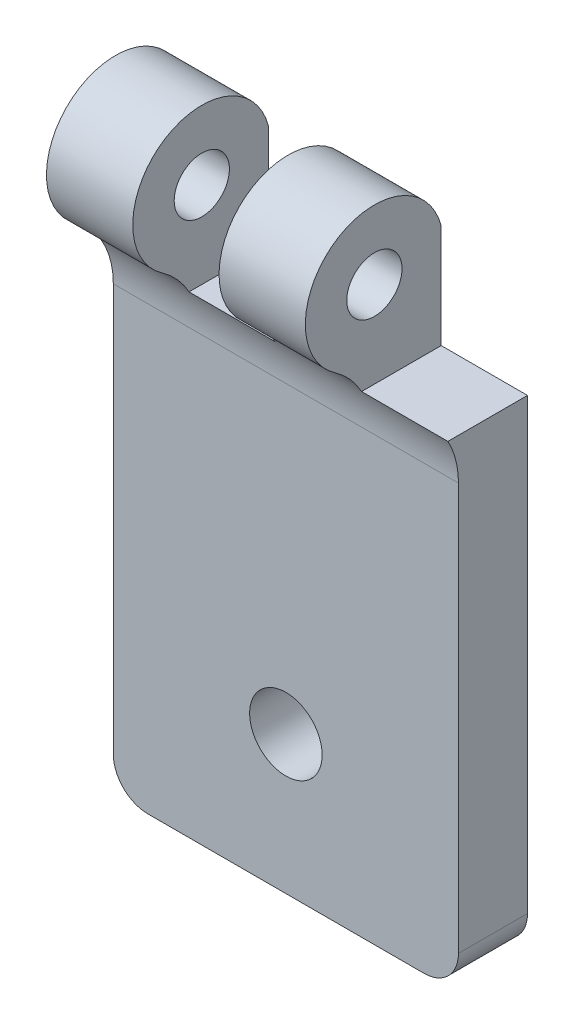
ISO-10303-21;
HEADER;
FILE_DESCRIPTION(('STEP AP214'),'2;1');
FILE_NAME('part.step','',(''),(''),'','','');
FILE_SCHEMA(('AUTOMOTIVE_DESIGN { 1 0 10303 214 1 1 1 1 }'));
ENDSEC;
DATA;
#1=APPLICATION_CONTEXT('core data for automotive mechanical design processes');
#2=APPLICATION_PROTOCOL_DEFINITION('international standard','automotive_design',2000,#1);
#3=PRODUCT_CONTEXT('',#1,'mechanical');
#4=PRODUCT('Part','Part','',(#3));
#5=PRODUCT_RELATED_PRODUCT_CATEGORY('part','',(#4));
#6=PRODUCT_DEFINITION_FORMATION('','',#4);
#7=PRODUCT_DEFINITION_CONTEXT('part definition',#1,'design');
#8=PRODUCT_DEFINITION('design','',#6,#7);
#9=PRODUCT_DEFINITION_SHAPE('','',#8);
#10=(LENGTH_UNIT() NAMED_UNIT(*) SI_UNIT(.MILLI.,.METRE.));
#11=(NAMED_UNIT(*) PLANE_ANGLE_UNIT() SI_UNIT($,.RADIAN.));
#12=(NAMED_UNIT(*) SI_UNIT($,.STERADIAN.) SOLID_ANGLE_UNIT());
#13=UNCERTAINTY_MEASURE_WITH_UNIT(LENGTH_MEASURE(1.E-05),#10,'distance_accuracy_value','');
#14=(GEOMETRIC_REPRESENTATION_CONTEXT(3) GLOBAL_UNCERTAINTY_ASSIGNED_CONTEXT((#13)) GLOBAL_UNIT_ASSIGNED_CONTEXT((#10,
#11,#12)) REPRESENTATION_CONTEXT('',''));
#15=CARTESIAN_POINT('',(0.,0.,0.));
#16=DIRECTION('',(0.,0.,1.));
#17=DIRECTION('',(1.,0.,0.));
#18=AXIS2_PLACEMENT_3D('',#15,#16,#17);
#19=CARTESIAN_POINT('',(-31.2224351555829,32.9979661007594,3.87245762594928));
#20=DIRECTION('',(1.,0.,0.));
#21=DIRECTION('',(0.,0.,-1.));
#22=AXIS2_PLACEMENT_3D('',#19,#20,#21);
#23=CYLINDRICAL_SURFACE('',#22,4.);
#24=CARTESIAN_POINT('',(-10.,32.9979661007594,3.87245762594928));
#25=DIRECTION('',(1.,0.,0.));
#26=DIRECTION('',(0.,0.,-1.));
#27=AXIS2_PLACEMENT_3D('',#24,#25,#26);
#28=CIRCLE('',#27,4.);
#29=CARTESIAN_POINT('',(-10.,29.7106298545688,6.1513653477496));
#30=VERTEX_POINT('',#29);
#31=CARTESIAN_POINT('',(-10.,34.,0.));
#32=VERTEX_POINT('',#31);
#33=EDGE_CURVE('E140',#30,#32,#28,.F.);
#34=ORIENTED_EDGE('',*,*,#33,.F.);
#35=DIRECTION('',(1.,0.,0.));
#36=VECTOR('',#35,1.);
#37=CARTESIAN_POINT('',(-31.2224351555829,29.7106298545688,6.1513653477496));
#38=LINE('',#37,#36);
#39=CARTESIAN_POINT('',(-5.,29.7106298545688,6.1513653477496));
#40=VERTEX_POINT('',#39);
#41=EDGE_CURVE('E198',#30,#40,#38,.T.);
#42=ORIENTED_EDGE('',*,*,#41,.T.);
#43=CARTESIAN_POINT('',(-5.,32.9979661007594,3.87245762594928));
#44=DIRECTION('',(-1.,0.,0.));
#45=DIRECTION('',(0.,0.,1.));
#46=AXIS2_PLACEMENT_3D('',#43,#44,#45);
#47=CIRCLE('',#46,4.);
#48=CARTESIAN_POINT('',(-5.,34.,0.));
#49=VERTEX_POINT('',#48);
#50=EDGE_CURVE('E172',#49,#40,#47,.F.);
#51=ORIENTED_EDGE('',*,*,#50,.F.);
#52=DIRECTION('',(-1.,0.,0.));
#53=VECTOR('',#52,1.);
#54=CARTESIAN_POINT('',(0.,34.,0.));
#55=LINE('',#54,#53);
#56=EDGE_CURVE('E202',#49,#32,#55,.T.);
#57=ORIENTED_EDGE('',*,*,#56,.T.);
#58=EDGE_LOOP('',(#34,#42,#51,#57));
#59=FACE_BOUND('',#58,.T.);
#60=ADVANCED_FACE('F32',(#59),#23,.T.);
#61=CARTESIAN_POINT('',(-20.,32.9979661007594,3.87245762594928));
#62=DIRECTION('',(1.,0.,0.));
#63=DIRECTION('',(0.,0.,-1.));
#64=AXIS2_PLACEMENT_3D('',#61,#62,#63);
#65=CYLINDRICAL_SURFACE('',#64,1.6);
#66=CARTESIAN_POINT('',(-10.,32.9979661007594,3.87245762594928));
#67=DIRECTION('',(1.,0.,0.));
#68=DIRECTION('',(0.,0.,-1.));
#69=AXIS2_PLACEMENT_3D('',#66,#67,#68);
#70=CIRCLE('',#69,1.6);
#71=CARTESIAN_POINT('',(-10.,32.9979661007594,2.27245762594928));
#72=VERTEX_POINT('',#71);
#73=EDGE_CURVE('E157',#72,#72,#70,.F.);
#74=ORIENTED_EDGE('',*,*,#73,.T.);
#75=EDGE_LOOP('',(#74));
#76=FACE_BOUND('',#75,.T.);
#77=CARTESIAN_POINT('',(-5.,32.9979661007594,3.87245762594928));
#78=DIRECTION('',(-1.,0.,0.));
#79=DIRECTION('',(0.,0.,1.));
#80=AXIS2_PLACEMENT_3D('',#77,#78,#79);
#81=CIRCLE('',#80,1.6);
#82=CARTESIAN_POINT('',(-5.,32.9979661007594,5.47245762594928));
#83=VERTEX_POINT('',#82);
#84=EDGE_CURVE('E167',#83,#83,#81,.F.);
#85=ORIENTED_EDGE('',*,*,#84,.T.);
#86=EDGE_LOOP('',(#85));
#87=FACE_BOUND('',#86,.T.);
#88=ADVANCED_FACE('F244',(#76,#87),#65,.F.);
#89=CARTESIAN_POINT('',(0.,0.,4.));
#90=DIRECTION('',(-1.,0.,0.));
#91=DIRECTION('',(0.,0.,1.));
#92=AXIS2_PLACEMENT_3D('',#89,#90,#91);
#93=PLANE('',#92);
#94=DIRECTION('',(0.,1.,0.));
#95=VECTOR('',#94,1.);
#96=CARTESIAN_POINT('',(0.,0.,0.));
#97=LINE('',#96,#95);
#98=CARTESIAN_POINT('',(0.,2.,0.));
#99=VERTEX_POINT('',#98);
#100=CARTESIAN_POINT('',(0.,28.,0.));
#101=VERTEX_POINT('',#100);
#102=EDGE_CURVE('E187',#99,#101,#97,.T.);
#103=ORIENTED_EDGE('',*,*,#102,.T.);
#104=DIRECTION('',(0.,0.,-1.));
#105=VECTOR('',#104,1.);
#106=CARTESIAN_POINT('',(0.,28.,7.87245762594928));
#107=LINE('',#106,#105);
#108=CARTESIAN_POINT('',(0.,28.,4.61285928029324));
#109=VERTEX_POINT('',#108);
#110=EDGE_CURVE('E165',#109,#101,#107,.T.);
#111=ORIENTED_EDGE('',*,*,#110,.F.);
#112=CARTESIAN_POINT('',(0.,25.6014595468304,9.));
#113=DIRECTION('',(-1.,0.,0.));
#114=DIRECTION('',(0.,0.,1.));
#115=AXIS2_PLACEMENT_3D('',#112,#113,#114);
#116=CIRCLE('',#115,5.);
#117=CARTESIAN_POINT('',(0.,25.6014595468304,4.));
#118=VERTEX_POINT('',#117);
#119=EDGE_CURVE('E214',#109,#118,#116,.T.);
#120=ORIENTED_EDGE('',*,*,#119,.T.);
#121=DIRECTION('',(0.,1.,0.));
#122=VECTOR('',#121,1.);
#123=CARTESIAN_POINT('',(0.,0.,4.));
#124=LINE('',#123,#122);
#125=CARTESIAN_POINT('',(0.,2.,4.));
#126=VERTEX_POINT('',#125);
#127=EDGE_CURVE('E188',#126,#118,#124,.T.);
#128=ORIENTED_EDGE('',*,*,#127,.F.);
#129=DIRECTION('',(0.,0.,-1.));
#130=VECTOR('',#129,1.);
#131=CARTESIAN_POINT('',(0.,2.,4.));
#132=LINE('',#131,#130);
#133=EDGE_CURVE('E218',#126,#99,#132,.T.);
#134=ORIENTED_EDGE('',*,*,#133,.T.);
#135=EDGE_LOOP('',(#103,#111,#120,#128,#134));
#136=FACE_BOUND('',#135,.T.);
#137=ADVANCED_FACE('F265',(#136),#93,.F.);
#138=CARTESIAN_POINT('',(-20.,0.,4.));
#139=DIRECTION('',(1.,0.,0.));
#140=DIRECTION('',(0.,0.,-1.));
#141=AXIS2_PLACEMENT_3D('',#138,#139,#140);
#142=PLANE('',#141);
#143=CARTESIAN_POINT('',(-20.,32.9979661007594,3.87245762594928));
#144=DIRECTION('',(1.,0.,0.));
#145=DIRECTION('',(0.,0.,-1.));
#146=AXIS2_PLACEMENT_3D('',#143,#144,#145);
#147=CIRCLE('',#146,1.6);
#148=CARTESIAN_POINT('',(-20.,32.9979661007594,2.27245762594928));
#149=VERTEX_POINT('',#148);
#150=EDGE_CURVE('E179',#149,#149,#147,.T.);
#151=ORIENTED_EDGE('',*,*,#150,.T.);
#152=EDGE_LOOP('',(#151));
#153=FACE_BOUND('',#152,.T.);
#154=DIRECTION('',(0.,-1.,0.));
#155=VECTOR('',#154,1.);
#156=CARTESIAN_POINT('',(-20.,0.,0.));
#157=LINE('',#156,#155);
#158=CARTESIAN_POINT('',(-20.,34.,0.));
#159=VERTEX_POINT('',#158);
#160=CARTESIAN_POINT('',(-20.,2.,0.));
#161=VERTEX_POINT('',#160);
#162=EDGE_CURVE('E204',#159,#161,#157,.T.);
#163=ORIENTED_EDGE('',*,*,#162,.T.);
#164=DIRECTION('',(0.,0.,-1.));
#165=VECTOR('',#164,1.);
#166=CARTESIAN_POINT('',(-20.,2.,4.));
#167=LINE('',#166,#165);
#168=CARTESIAN_POINT('',(-20.,2.,4.));
#169=VERTEX_POINT('',#168);
#170=EDGE_CURVE('E234',#161,#169,#167,.F.);
#171=ORIENTED_EDGE('',*,*,#170,.T.);
#172=DIRECTION('',(0.,-1.,0.));
#173=VECTOR('',#172,1.);
#174=CARTESIAN_POINT('',(-20.,0.,4.));
#175=LINE('',#174,#173);
#176=CARTESIAN_POINT('',(-20.,25.6014595468304,4.));
#177=VERTEX_POINT('',#176);
#178=EDGE_CURVE('E191',#177,#169,#175,.T.);
#179=ORIENTED_EDGE('',*,*,#178,.F.);
#180=CARTESIAN_POINT('',(-20.,25.6014595468304,9.));
#181=DIRECTION('',(1.,0.,0.));
#182=DIRECTION('',(0.,0.,-1.));
#183=AXIS2_PLACEMENT_3D('',#180,#181,#182);
#184=CIRCLE('',#183,5.);
#185=CARTESIAN_POINT('',(-20.,29.7106298545688,6.1513653477496));
#186=VERTEX_POINT('',#185);
#187=EDGE_CURVE('E216',#177,#186,#184,.T.);
#188=ORIENTED_EDGE('',*,*,#187,.T.);
#189=CARTESIAN_POINT('',(-20.,32.9979661007594,3.87245762594928));
#190=DIRECTION('',(1.,0.,0.));
#191=DIRECTION('',(0.,0.,-1.));
#192=AXIS2_PLACEMENT_3D('',#189,#190,#191);
#193=CIRCLE('',#192,4.);
#194=EDGE_CURVE('E184',#186,#159,#193,.F.);
#195=ORIENTED_EDGE('',*,*,#194,.T.);
#196=EDGE_LOOP('',(#163,#171,#179,#188,#195));
#197=FACE_BOUND('',#196,.T.);
#198=ADVANCED_FACE('F295',(#153,#197),#142,.F.);
#199=CARTESIAN_POINT('',(0.,0.,4.));
#200=DIRECTION('',(0.,1.,0.));
#201=DIRECTION('',(-1.,0.,0.));
#202=AXIS2_PLACEMENT_3D('',#199,#200,#201);
#203=PLANE('',#202);
#204=DIRECTION('',(1.,0.,0.));
#205=VECTOR('',#204,1.);
#206=CARTESIAN_POINT('',(0.,0.,0.));
#207=LINE('',#206,#205);
#208=CARTESIAN_POINT('',(-18.,0.,0.));
#209=VERTEX_POINT('',#208);
#210=CARTESIAN_POINT('',(-2.,0.,0.));
#211=VERTEX_POINT('',#210);
#212=EDGE_CURVE('E192',#209,#211,#207,.T.);
#213=ORIENTED_EDGE('',*,*,#212,.T.);
#214=DIRECTION('',(0.,0.,-1.));
#215=VECTOR('',#214,1.);
#216=CARTESIAN_POINT('',(-2.,0.,4.));
#217=LINE('',#216,#215);
#218=CARTESIAN_POINT('',(-2.,0.,4.));
#219=VERTEX_POINT('',#218);
#220=EDGE_CURVE('E228',#211,#219,#217,.F.);
#221=ORIENTED_EDGE('',*,*,#220,.T.);
#222=DIRECTION('',(1.,0.,0.));
#223=VECTOR('',#222,1.);
#224=CARTESIAN_POINT('',(0.,0.,4.));
#225=LINE('',#224,#223);
#226=CARTESIAN_POINT('',(-18.,0.,4.));
#227=VERTEX_POINT('',#226);
#228=EDGE_CURVE('E195',#227,#219,#225,.T.);
#229=ORIENTED_EDGE('',*,*,#228,.F.);
#230=DIRECTION('',(0.,0.,-1.));
#231=VECTOR('',#230,1.);
#232=CARTESIAN_POINT('',(-18.,0.,4.));
#233=LINE('',#232,#231);
#234=EDGE_CURVE('E225',#227,#209,#233,.T.);
#235=ORIENTED_EDGE('',*,*,#234,.T.);
#236=EDGE_LOOP('',(#213,#221,#229,#235));
#237=FACE_BOUND('',#236,.T.);
#238=ADVANCED_FACE('F298',(#237),#203,.F.);
#239=CARTESIAN_POINT('',(0.,0.,4.));
#240=DIRECTION('',(0.,0.,1.));
#241=DIRECTION('',(1.,0.,0.));
#242=AXIS2_PLACEMENT_3D('',#239,#240,#241);
#243=PLANE('',#242);
#244=CARTESIAN_POINT('',(-10.,8.,4.));
#245=DIRECTION('',(0.,0.,1.));
#246=DIRECTION('',(1.,0.,0.));
#247=AXIS2_PLACEMENT_3D('',#244,#245,#246);
#248=CIRCLE('',#247,2.1);
#249=CARTESIAN_POINT('',(-7.9,8.,4.));
#250=VERTEX_POINT('',#249);
#251=EDGE_CURVE('E175',#250,#250,#248,.T.);
#252=ORIENTED_EDGE('',*,*,#251,.F.);
#253=EDGE_LOOP('',(#252));
#254=FACE_BOUND('',#253,.T.);
#255=ORIENTED_EDGE('',*,*,#228,.T.);
#256=CARTESIAN_POINT('',(-2.,2.,4.));
#257=DIRECTION('',(0.,0.,1.));
#258=DIRECTION('',(1.,0.,0.));
#259=AXIS2_PLACEMENT_3D('',#256,#257,#258);
#260=CIRCLE('',#259,2.);
#261=EDGE_CURVE('E232',#219,#126,#260,.T.);
#262=ORIENTED_EDGE('',*,*,#261,.T.);
#263=ORIENTED_EDGE('',*,*,#127,.T.);
#264=DIRECTION('',(-1.,0.,0.));
#265=VECTOR('',#264,1.);
#266=CARTESIAN_POINT('',(-20.,25.6014595468304,4.));
#267=LINE('',#266,#265);
#268=EDGE_CURVE('E212',#118,#177,#267,.T.);
#269=ORIENTED_EDGE('',*,*,#268,.T.);
#270=ORIENTED_EDGE('',*,*,#178,.T.);
#271=CARTESIAN_POINT('',(-18.,2.,4.));
#272=DIRECTION('',(0.,0.,1.));
#273=DIRECTION('',(1.,0.,0.));
#274=AXIS2_PLACEMENT_3D('',#271,#272,#273);
#275=CIRCLE('',#274,2.);
#276=EDGE_CURVE('E230',#169,#227,#275,.T.);
#277=ORIENTED_EDGE('',*,*,#276,.T.);
#278=EDGE_LOOP('',(#255,#262,#263,#269,#270,#277));
#279=FACE_BOUND('',#278,.T.);
#280=ADVANCED_FACE('F278',(#254,#279),#243,.T.);
#281=CARTESIAN_POINT('',(0.,0.,0.));
#282=DIRECTION('',(0.,0.,1.));
#283=DIRECTION('',(1.,0.,0.));
#284=AXIS2_PLACEMENT_3D('',#281,#282,#283);
#285=PLANE('',#284);
#286=CARTESIAN_POINT('',(-10.,8.,0.));
#287=DIRECTION('',(0.,0.,1.));
#288=DIRECTION('',(1.,0.,0.));
#289=AXIS2_PLACEMENT_3D('',#286,#287,#288);
#290=CIRCLE('',#289,2.1);
#291=CARTESIAN_POINT('',(-7.9,8.,0.));
#292=VERTEX_POINT('',#291);
#293=EDGE_CURVE('E176',#292,#292,#290,.T.);
#294=ORIENTED_EDGE('',*,*,#293,.T.);
#295=EDGE_LOOP('',(#294));
#296=FACE_BOUND('',#295,.T.);
#297=DIRECTION('',(-1.,0.,0.));
#298=VECTOR('',#297,1.);
#299=CARTESIAN_POINT('',(-10.,28.,0.));
#300=LINE('',#299,#298);
#301=CARTESIAN_POINT('',(-10.,28.,0.));
#302=VERTEX_POINT('',#301);
#303=CARTESIAN_POINT('',(-15.,28.,0.));
#304=VERTEX_POINT('',#303);
#305=EDGE_CURVE('E129',#302,#304,#300,.T.);
#306=ORIENTED_EDGE('',*,*,#305,.F.);
#307=DIRECTION('',(0.,-1.,0.));
#308=VECTOR('',#307,1.);
#309=CARTESIAN_POINT('',(-10.,28.,0.));
#310=LINE('',#309,#308);
#311=EDGE_CURVE('E137',#32,#302,#310,.T.);
#312=ORIENTED_EDGE('',*,*,#311,.F.);
#313=ORIENTED_EDGE('',*,*,#56,.F.);
#314=DIRECTION('',(0.,1.,0.));
#315=VECTOR('',#314,1.);
#316=CARTESIAN_POINT('',(-5.,28.,0.));
#317=LINE('',#316,#315);
#318=CARTESIAN_POINT('',(-5.,28.,0.));
#319=VERTEX_POINT('',#318);
#320=EDGE_CURVE('E163',#319,#49,#317,.T.);
#321=ORIENTED_EDGE('',*,*,#320,.F.);
#322=DIRECTION('',(-1.,0.,0.));
#323=VECTOR('',#322,1.);
#324=CARTESIAN_POINT('',(0.,28.,0.));
#325=LINE('',#324,#323);
#326=EDGE_CURVE('E161',#101,#319,#325,.T.);
#327=ORIENTED_EDGE('',*,*,#326,.F.);
#328=ORIENTED_EDGE('',*,*,#102,.F.);
#329=CARTESIAN_POINT('',(-2.,2.,0.));
#330=DIRECTION('',(0.,0.,1.));
#331=DIRECTION('',(1.,0.,0.));
#332=AXIS2_PLACEMENT_3D('',#329,#330,#331);
#333=CIRCLE('',#332,2.);
#334=EDGE_CURVE('E223',#99,#211,#333,.F.);
#335=ORIENTED_EDGE('',*,*,#334,.T.);
#336=ORIENTED_EDGE('',*,*,#212,.F.);
#337=CARTESIAN_POINT('',(-18.,2.,0.));
#338=DIRECTION('',(0.,0.,1.));
#339=DIRECTION('',(1.,0.,0.));
#340=AXIS2_PLACEMENT_3D('',#337,#338,#339);
#341=CIRCLE('',#340,2.);
#342=EDGE_CURVE('E221',#209,#161,#341,.F.);
#343=ORIENTED_EDGE('',*,*,#342,.T.);
#344=ORIENTED_EDGE('',*,*,#162,.F.);
#345=CARTESIAN_POINT('',(-15.,34.,0.));
#346=VERTEX_POINT('',#345);
#347=EDGE_CURVE('E201',#346,#159,#55,.T.);
#348=ORIENTED_EDGE('',*,*,#347,.F.);
#349=DIRECTION('',(0.,1.,0.));
#350=VECTOR('',#349,1.);
#351=CARTESIAN_POINT('',(-15.,28.,0.));
#352=LINE('',#351,#350);
#353=EDGE_CURVE('E134',#304,#346,#352,.T.);
#354=ORIENTED_EDGE('',*,*,#353,.F.);
#355=EDGE_LOOP('',(#306,#312,#313,#321,#327,#328,#335,#336,#343,#344,#348,#354));
#356=FACE_BOUND('',#355,.T.);
#357=ADVANCED_FACE('F145',(#296,#356),#285,.F.);
#358=CARTESIAN_POINT('',(-15.,29.7106298545688,6.1513653477496));
#359=VERTEX_POINT('',#358);
#360=EDGE_CURVE('E209',#186,#359,#38,.T.);
#361=ORIENTED_EDGE('',*,*,#360,.T.);
#362=CARTESIAN_POINT('',(-15.,32.9979661007594,3.87245762594928));
#363=DIRECTION('',(-1.,0.,0.));
#364=DIRECTION('',(0.,0.,1.));
#365=AXIS2_PLACEMENT_3D('',#362,#363,#364);
#366=CIRCLE('',#365,4.);
#367=EDGE_CURVE('E155',#346,#359,#366,.F.);
#368=ORIENTED_EDGE('',*,*,#367,.F.);
#369=ORIENTED_EDGE('',*,*,#347,.T.);
#370=ORIENTED_EDGE('',*,*,#194,.F.);
#371=EDGE_LOOP('',(#361,#368,#369,#370));
#372=FACE_BOUND('',#371,.T.);
#373=ADVANCED_FACE('F261',(#372),#23,.T.);
#374=CARTESIAN_POINT('',(-31.2224351555829,25.6014595468304,9.));
#375=DIRECTION('',(1.,0.,0.));
#376=DIRECTION('',(0.,0.,-1.));
#377=AXIS2_PLACEMENT_3D('',#374,#375,#376);
#378=CYLINDRICAL_SURFACE('',#377,5.);
#379=ORIENTED_EDGE('',*,*,#41,.F.);
#380=CARTESIAN_POINT('',(-10.,25.6014595468304,9.));
#381=DIRECTION('',(1.,0.,0.));
#382=DIRECTION('',(0.,0.,-1.));
#383=AXIS2_PLACEMENT_3D('',#380,#381,#382);
#384=CIRCLE('',#383,5.);
#385=CARTESIAN_POINT('',(-10.,28.,4.61285928029323));
#386=VERTEX_POINT('',#385);
#387=EDGE_CURVE('E158',#30,#386,#384,.F.);
#388=ORIENTED_EDGE('',*,*,#387,.T.);
#389=DIRECTION('',(1.,0.,0.));
#390=VECTOR('',#389,1.);
#391=CARTESIAN_POINT('',(-31.2224351555829,28.,4.61285928029323));
#392=LINE('',#391,#390);
#393=CARTESIAN_POINT('',(-15.,28.,4.61285928029323));
#394=VERTEX_POINT('',#393);
#395=EDGE_CURVE('E11',#386,#394,#392,.F.);
#396=ORIENTED_EDGE('',*,*,#395,.T.);
#397=CARTESIAN_POINT('',(-15.,25.6014595468304,9.));
#398=DIRECTION('',(-1.,0.,0.));
#399=DIRECTION('',(0.,0.,1.));
#400=AXIS2_PLACEMENT_3D('',#397,#398,#399);
#401=CIRCLE('',#400,5.);
#402=EDGE_CURVE('E152',#394,#359,#401,.F.);
#403=ORIENTED_EDGE('',*,*,#402,.T.);
#404=ORIENTED_EDGE('',*,*,#360,.F.);
#405=ORIENTED_EDGE('',*,*,#187,.F.);
#406=ORIENTED_EDGE('',*,*,#268,.F.);
#407=ORIENTED_EDGE('',*,*,#119,.F.);
#408=DIRECTION('',(1.,0.,0.));
#409=VECTOR('',#408,1.);
#410=CARTESIAN_POINT('',(-31.2224351555829,28.,4.61285928029324));
#411=LINE('',#410,#409);
#412=CARTESIAN_POINT('',(-5.,28.,4.61285928029324));
#413=VERTEX_POINT('',#412);
#414=EDGE_CURVE('E40',#109,#413,#411,.F.);
#415=ORIENTED_EDGE('',*,*,#414,.T.);
#416=CARTESIAN_POINT('',(-5.,25.6014595468304,9.));
#417=DIRECTION('',(-1.,0.,0.));
#418=DIRECTION('',(0.,0.,1.));
#419=AXIS2_PLACEMENT_3D('',#416,#417,#418);
#420=CIRCLE('',#419,5.);
#421=EDGE_CURVE('E169',#413,#40,#420,.F.);
#422=ORIENTED_EDGE('',*,*,#421,.T.);
#423=EDGE_LOOP('',(#379,#388,#396,#403,#404,#405,#406,#407,#415,#422));
#424=FACE_BOUND('',#423,.T.);
#425=ADVANCED_FACE('F270',(#424),#378,.F.);
#426=CARTESIAN_POINT('',(-15.,32.9979661007594,3.87245762594928));
#427=DIRECTION('',(-1.,0.,0.));
#428=DIRECTION('',(0.,0.,1.));
#429=AXIS2_PLACEMENT_3D('',#426,#427,#428);
#430=CIRCLE('',#429,1.6);
#431=CARTESIAN_POINT('',(-15.,32.9979661007594,5.47245762594928));
#432=VERTEX_POINT('',#431);
#433=EDGE_CURVE('E150',#432,#432,#430,.F.);
#434=ORIENTED_EDGE('',*,*,#433,.T.);
#435=EDGE_LOOP('',(#434));
#436=FACE_BOUND('',#435,.T.);
#437=ORIENTED_EDGE('',*,*,#150,.F.);
#438=EDGE_LOOP('',(#437));
#439=FACE_BOUND('',#438,.T.);
#440=ADVANCED_FACE('F267',(#436,#439),#65,.F.);
#441=CARTESIAN_POINT('',(-10.,8.,0.));
#442=DIRECTION('',(0.,0.,1.));
#443=DIRECTION('',(1.,0.,0.));
#444=AXIS2_PLACEMENT_3D('',#441,#442,#443);
#445=CYLINDRICAL_SURFACE('',#444,2.1);
#446=ORIENTED_EDGE('',*,*,#293,.F.);
#447=EDGE_LOOP('',(#446));
#448=FACE_BOUND('',#447,.T.);
#449=ORIENTED_EDGE('',*,*,#251,.T.);
#450=EDGE_LOOP('',(#449));
#451=FACE_BOUND('',#450,.T.);
#452=ADVANCED_FACE('F292',(#448,#451),#445,.F.);
#453=CARTESIAN_POINT('',(-2.,2.,4.));
#454=DIRECTION('',(0.,0.,-1.));
#455=DIRECTION('',(-1.,0.,0.));
#456=AXIS2_PLACEMENT_3D('',#453,#454,#455);
#457=CYLINDRICAL_SURFACE('',#456,2.);
#458=ORIENTED_EDGE('',*,*,#261,.F.);
#459=ORIENTED_EDGE('',*,*,#220,.F.);
#460=ORIENTED_EDGE('',*,*,#334,.F.);
#461=ORIENTED_EDGE('',*,*,#133,.F.);
#462=EDGE_LOOP('',(#458,#459,#460,#461));
#463=FACE_BOUND('',#462,.T.);
#464=ADVANCED_FACE('F313',(#463),#457,.T.);
#465=CARTESIAN_POINT('',(-18.,2.,4.));
#466=DIRECTION('',(0.,0.,-1.));
#467=DIRECTION('',(-1.,0.,0.));
#468=AXIS2_PLACEMENT_3D('',#465,#466,#467);
#469=CYLINDRICAL_SURFACE('',#468,2.);
#470=ORIENTED_EDGE('',*,*,#276,.F.);
#471=ORIENTED_EDGE('',*,*,#170,.F.);
#472=ORIENTED_EDGE('',*,*,#342,.F.);
#473=ORIENTED_EDGE('',*,*,#234,.F.);
#474=EDGE_LOOP('',(#470,#471,#472,#473));
#475=FACE_BOUND('',#474,.T.);
#476=ADVANCED_FACE('F34',(#475),#469,.T.);
#477=CARTESIAN_POINT('',(0.,28.,7.87245762594928));
#478=DIRECTION('',(0.,-1.,0.));
#479=DIRECTION('',(1.,0.,0.));
#480=AXIS2_PLACEMENT_3D('',#477,#478,#479);
#481=PLANE('',#480);
#482=ORIENTED_EDGE('',*,*,#110,.T.);
#483=ORIENTED_EDGE('',*,*,#326,.T.);
#484=DIRECTION('',(0.,0.,-1.));
#485=VECTOR('',#484,1.);
#486=CARTESIAN_POINT('',(-5.,28.,7.87245762594928));
#487=LINE('',#486,#485);
#488=EDGE_CURVE('E55',#413,#319,#487,.T.);
#489=ORIENTED_EDGE('',*,*,#488,.F.);
#490=ORIENTED_EDGE('',*,*,#414,.F.);
#491=EDGE_LOOP('',(#482,#483,#489,#490));
#492=FACE_BOUND('',#491,.T.);
#493=ADVANCED_FACE('F320',(#492),#481,.F.);
#494=CARTESIAN_POINT('',(-5.,28.,7.87245762594928));
#495=DIRECTION('',(-1.,0.,0.));
#496=DIRECTION('',(0.,0.,1.));
#497=AXIS2_PLACEMENT_3D('',#494,#495,#496);
#498=PLANE('',#497);
#499=ORIENTED_EDGE('',*,*,#50,.T.);
#500=ORIENTED_EDGE('',*,*,#421,.F.);
#501=ORIENTED_EDGE('',*,*,#488,.T.);
#502=ORIENTED_EDGE('',*,*,#320,.T.);
#503=EDGE_LOOP('',(#499,#500,#501,#502));
#504=FACE_BOUND('',#503,.T.);
#505=ORIENTED_EDGE('',*,*,#84,.F.);
#506=EDGE_LOOP('',(#505));
#507=FACE_BOUND('',#506,.T.);
#508=ADVANCED_FACE('F255',(#504,#507),#498,.F.);
#509=CARTESIAN_POINT('',(-10.,28.,7.87245762594928));
#510=DIRECTION('',(0.,-1.,0.));
#511=DIRECTION('',(0.,0.,-1.));
#512=AXIS2_PLACEMENT_3D('',#509,#510,#511);
#513=PLANE('',#512);
#514=DIRECTION('',(0.,0.,-1.));
#515=VECTOR('',#514,1.);
#516=CARTESIAN_POINT('',(-10.,28.,7.87245762594928));
#517=LINE('',#516,#515);
#518=EDGE_CURVE('E125',#386,#302,#517,.T.);
#519=ORIENTED_EDGE('',*,*,#518,.T.);
#520=ORIENTED_EDGE('',*,*,#305,.T.);
#521=DIRECTION('',(0.,0.,-1.));
#522=VECTOR('',#521,1.);
#523=CARTESIAN_POINT('',(-15.,28.,7.87245762594928));
#524=LINE('',#523,#522);
#525=EDGE_CURVE('E47',#394,#304,#524,.T.);
#526=ORIENTED_EDGE('',*,*,#525,.F.);
#527=ORIENTED_EDGE('',*,*,#395,.F.);
#528=EDGE_LOOP('',(#519,#520,#526,#527));
#529=FACE_BOUND('',#528,.T.);
#530=ADVANCED_FACE('F127',(#529),#513,.F.);
#531=CARTESIAN_POINT('',(-10.,28.,7.87245762594928));
#532=DIRECTION('',(1.,0.,0.));
#533=DIRECTION('',(0.,0.,-1.));
#534=AXIS2_PLACEMENT_3D('',#531,#532,#533);
#535=PLANE('',#534);
#536=ORIENTED_EDGE('',*,*,#33,.T.);
#537=ORIENTED_EDGE('',*,*,#311,.T.);
#538=ORIENTED_EDGE('',*,*,#518,.F.);
#539=ORIENTED_EDGE('',*,*,#387,.F.);
#540=EDGE_LOOP('',(#536,#537,#538,#539));
#541=FACE_BOUND('',#540,.T.);
#542=ORIENTED_EDGE('',*,*,#73,.F.);
#543=EDGE_LOOP('',(#542));
#544=FACE_BOUND('',#543,.T.);
#545=ADVANCED_FACE('F138',(#541,#544),#535,.F.);
#546=CARTESIAN_POINT('',(-15.,28.,7.87245762594928));
#547=DIRECTION('',(-1.,0.,0.));
#548=DIRECTION('',(0.,0.,1.));
#549=AXIS2_PLACEMENT_3D('',#546,#547,#548);
#550=PLANE('',#549);
#551=ORIENTED_EDGE('',*,*,#367,.T.);
#552=ORIENTED_EDGE('',*,*,#402,.F.);
#553=ORIENTED_EDGE('',*,*,#525,.T.);
#554=ORIENTED_EDGE('',*,*,#353,.T.);
#555=EDGE_LOOP('',(#551,#552,#553,#554));
#556=FACE_BOUND('',#555,.T.);
#557=ORIENTED_EDGE('',*,*,#433,.F.);
#558=EDGE_LOOP('',(#557));
#559=FACE_BOUND('',#558,.T.);
#560=ADVANCED_FACE('F247',(#556,#559),#550,.F.);
#561=CLOSED_SHELL('',(#60,#88,#137,#198,#238,#280,#357,#373,#425,#440,#452,#464,#476,#493,#508,
#530,#545,#560));
#562=MANIFOLD_SOLID_BREP('B2',#561);
#563=ADVANCED_BREP_SHAPE_REPRESENTATION('',(#18,#562),#14);
#564=SHAPE_DEFINITION_REPRESENTATION(#9,#563);
ENDSEC;
END-ISO-10303-21;
